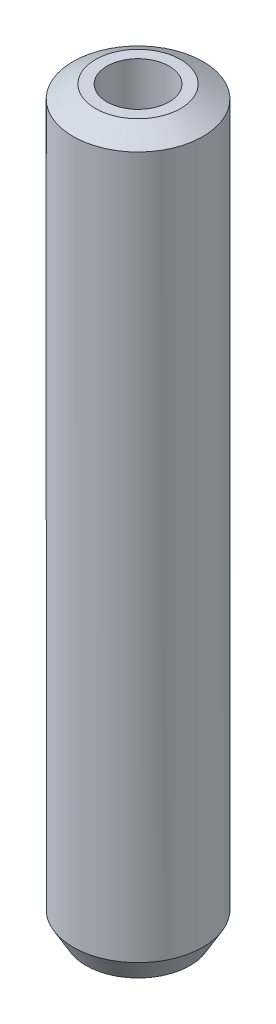
ISO-10303-21;
HEADER;
FILE_DESCRIPTION(('STEP AP214'),'2;1');
FILE_NAME('part.step','',(''),(''),'','','');
FILE_SCHEMA(('AUTOMOTIVE_DESIGN { 1 0 10303 214 1 1 1 1 }'));
ENDSEC;
DATA;
#1=APPLICATION_CONTEXT('core data for automotive mechanical design processes');
#2=APPLICATION_PROTOCOL_DEFINITION('international standard','automotive_design',2000,#1);
#3=PRODUCT_CONTEXT('',#1,'mechanical');
#4=PRODUCT('Part','Part','',(#3));
#5=PRODUCT_RELATED_PRODUCT_CATEGORY('part','',(#4));
#6=PRODUCT_DEFINITION_FORMATION('','',#4);
#7=PRODUCT_DEFINITION_CONTEXT('part definition',#1,'design');
#8=PRODUCT_DEFINITION('design','',#6,#7);
#9=PRODUCT_DEFINITION_SHAPE('','',#8);
#10=(LENGTH_UNIT() NAMED_UNIT(*) SI_UNIT(.MILLI.,.METRE.));
#11=(NAMED_UNIT(*) PLANE_ANGLE_UNIT() SI_UNIT($,.RADIAN.));
#12=(NAMED_UNIT(*) SI_UNIT($,.STERADIAN.) SOLID_ANGLE_UNIT());
#13=UNCERTAINTY_MEASURE_WITH_UNIT(LENGTH_MEASURE(1.E-05),#10,'distance_accuracy_value','');
#14=(GEOMETRIC_REPRESENTATION_CONTEXT(3) GLOBAL_UNCERTAINTY_ASSIGNED_CONTEXT((#13)) GLOBAL_UNIT_ASSIGNED_CONTEXT((#10,
#11,#12)) REPRESENTATION_CONTEXT('',''));
#15=CARTESIAN_POINT('',(0.,0.,0.));
#16=DIRECTION('',(0.,0.,1.));
#17=DIRECTION('',(1.,0.,0.));
#18=AXIS2_PLACEMENT_3D('',#15,#16,#17);
#19=CARTESIAN_POINT('',(0.,113.502418023381,0.));
#20=DIRECTION('',(0.,-1.,0.));
#21=DIRECTION('',(0.,0.,-1.));
#22=AXIS2_PLACEMENT_3D('',#19,#20,#21);
#23=CYLINDRICAL_SURFACE('',#22,10.);
#24=CARTESIAN_POINT('',(0.,111.508102450574,0.));
#25=DIRECTION('',(0.,1.,0.));
#26=DIRECTION('',(0.,0.,1.));
#27=AXIS2_PLACEMENT_3D('',#24,#25,#26);
#28=CIRCLE('',#27,10.);
#29=CARTESIAN_POINT('',(0.,111.508102450574,-10.));
#30=VERTEX_POINT('',#29);
#31=EDGE_CURVE('E50',#30,#30,#28,.F.);
#32=CARTESIAN_POINT('',(0.,3.45425589842778,0.));
#33=DIRECTION('',(0.,1.,0.));
#34=DIRECTION('',(0.,0.,1.));
#35=AXIS2_PLACEMENT_3D('',#32,#33,#34);
#36=CIRCLE('',#35,10.);
#37=CARTESIAN_POINT('',(0.,3.45425589842777,-10.));
#38=VERTEX_POINT('',#37);
#39=EDGE_CURVE('E51',#38,#38,#36,.T.);
#40=CARTESIAN_POINT('',(0.,111.508102450574,-10.));
#41=CARTESIAN_POINT('',(0.,110.382541548989,-10.));
#42=CARTESIAN_POINT('',(0.,109.256980647405,-10.));
#43=CARTESIAN_POINT('',(0.,107.005858844235,-10.));
#44=CARTESIAN_POINT('',(0.,105.88029794265,-10.));
#45=CARTESIAN_POINT('',(0.,103.62917613948,-10.));
#46=CARTESIAN_POINT('',(0.,102.503615237895,-10.));
#47=CARTESIAN_POINT('',(0.,100.252493434726,-10.));
#48=CARTESIAN_POINT('',(0.,99.1269325331408,-10.));
#49=CARTESIAN_POINT('',(0.,96.8758107299711,-10.));
#50=CARTESIAN_POINT('',(0.,95.7502498283862,-10.));
#51=CARTESIAN_POINT('',(0.,93.4991280252165,-10.));
#52=CARTESIAN_POINT('',(0.,92.3735671236316,-10.));
#53=CARTESIAN_POINT('',(0.,90.1224453204619,-10.));
#54=CARTESIAN_POINT('',(0.,88.9968844188771,-10.));
#55=CARTESIAN_POINT('',(0.,86.7457626157073,-10.));
#56=CARTESIAN_POINT('',(0.,85.6202017141225,-10.));
#57=CARTESIAN_POINT('',(0.,83.3690799109528,-10.));
#58=CARTESIAN_POINT('',(0.,82.2435190093679,-10.));
#59=CARTESIAN_POINT('',(0.,79.9923972061982,-10.));
#60=CARTESIAN_POINT('',(0.,78.8668363046133,-10.));
#61=CARTESIAN_POINT('',(0.,76.6157145014436,-10.));
#62=CARTESIAN_POINT('',(0.,75.4901535998587,-10.));
#63=CARTESIAN_POINT('',(0.,73.239031796689,-10.));
#64=CARTESIAN_POINT('',(0.,72.1134708951042,-10.));
#65=CARTESIAN_POINT('',(0.,69.8623490919344,-10.));
#66=CARTESIAN_POINT('',(0.,68.7367881903496,-10.));
#67=CARTESIAN_POINT('',(0.,66.4856663871799,-10.));
#68=CARTESIAN_POINT('',(0.,65.360105485595,-10.));
#69=CARTESIAN_POINT('',(0.,63.1089836824253,-10.));
#70=CARTESIAN_POINT('',(0.,61.9834227808404,-10.));
#71=CARTESIAN_POINT('',(0.,59.7323009776707,-10.));
#72=CARTESIAN_POINT('',(0.,58.6067400760859,-10.));
#73=CARTESIAN_POINT('',(0.,56.3556182729161,-10.));
#74=CARTESIAN_POINT('',(0.,55.2300573713313,-10.));
#75=CARTESIAN_POINT('',(0.,52.9789355681616,-10.));
#76=CARTESIAN_POINT('',(0.,51.8533746665767,-10.));
#77=CARTESIAN_POINT('',(0.,49.602252863407,-10.));
#78=CARTESIAN_POINT('',(0.,48.4766919618221,-10.));
#79=CARTESIAN_POINT('',(0.,46.2255701586524,-10.));
#80=CARTESIAN_POINT('',(0.,45.1000092570676,-10.));
#81=CARTESIAN_POINT('',(0.,42.8488874538978,-10.));
#82=CARTESIAN_POINT('',(0.,41.723326552313,-10.));
#83=CARTESIAN_POINT('',(0.,39.4722047491433,-10.));
#84=CARTESIAN_POINT('',(0.,38.3466438475584,-10.));
#85=CARTESIAN_POINT('',(0.,36.0955220443887,-10.));
#86=CARTESIAN_POINT('',(0.,34.9699611428038,-10.));
#87=CARTESIAN_POINT('',(0.,32.7188393396341,-10.));
#88=CARTESIAN_POINT('',(0.,31.5932784380492,-10.));
#89=CARTESIAN_POINT('',(0.,29.3421566348795,-10.));
#90=CARTESIAN_POINT('',(0.,28.2165957332947,-10.));
#91=CARTESIAN_POINT('',(0.,25.9654739301249,-10.));
#92=CARTESIAN_POINT('',(0.,24.8399130285401,-10.));
#93=CARTESIAN_POINT('',(0.,22.5887912253704,-10.));
#94=CARTESIAN_POINT('',(0.,21.4632303237855,-10.));
#95=CARTESIAN_POINT('',(0.,19.2121085206158,-10.));
#96=CARTESIAN_POINT('',(0.,18.0865476190309,-10.));
#97=CARTESIAN_POINT('',(0.,15.8354258158612,-10.));
#98=CARTESIAN_POINT('',(0.,14.7098649142764,-10.));
#99=CARTESIAN_POINT('',(0.,12.4587431111066,-10.));
#100=CARTESIAN_POINT('',(0.,11.3331822095218,-10.));
#101=CARTESIAN_POINT('',(0.,9.08206040635207,-10.));
#102=CARTESIAN_POINT('',(0.,7.95649950476721,-10.));
#103=CARTESIAN_POINT('',(0.,5.70537770159749,-10.));
#104=CARTESIAN_POINT('',(0.,4.57981680001263,-10.));
#105=CARTESIAN_POINT('',(0.,3.45425589842777,-10.));
#106=B_SPLINE_CURVE_WITH_KNOTS('',3,(#40,#41,#42,#43,#44,#45,#46,#47,#48,#49,#50,#51,#52,#53,
#54,#55,#56,#57,#58,#59,#60,#61,#62,#63,#64,#65,#66,#67,#68,#69,#70,#71,#72,#73,#74,#75,#76,#77,
#78,#79,#80,#81,#82,#83,#84,#85,#86,#87,#88,#89,#90,#91,#92,#93,#94,#95,#96,#97,#98,#99,#100,
#101,#102,#103,#104,#105),.UNSPECIFIED.,.F.,.F.,(4,2,2,2,2,2,2,2,2,2,2,2,2,2,2,2,2,2,2,2,2,2,2,
2,2,2,2,2,2,2,2,2,4),(0.,3.37668270475458,6.75336540950916,10.1300481142637,13.5067308190183,
16.8834135237729,20.2600962285275,23.636778933282,27.0134616380366,30.3901443427912,
33.7668270475458,37.1435097523004,40.5201924570549,43.8968751618095,47.2735578665641,
50.6502405713187,54.0269232760733,57.4036059808278,60.7802886855824,64.156971390337,
67.5336540950916,70.9103367998461,74.2870195046007,77.6637022093553,81.0403849141099,
84.4170676188645,87.793750323619,91.1704330283736,94.5471157331282,97.9237984378828,
101.300481142637,104.677163847392,108.053846552146),.UNSPECIFIED.);
#107=EDGE_CURVE('BSEAM39',#30,#38,#106,.T.);
#108=ORIENTED_EDGE('',*,*,#31,.T.);
#109=ORIENTED_EDGE('',*,*,#39,.T.);
#110=ORIENTED_EDGE('',*,*,#107,.T.);
#111=ORIENTED_EDGE('',*,*,#107,.F.);
#112=EDGE_LOOP('',(#108,#110,#109,#111));
#113=FACE_BOUND('',#112,.T.);
#114=ADVANCED_FACE('F39',(#113),#23,.T.);
#115=CARTESIAN_POINT('',(0.,113.502418023381,0.));
#116=DIRECTION('',(0.,1.,0.));
#117=DIRECTION('',(0.,0.,1.));
#118=AXIS2_PLACEMENT_3D('',#115,#116,#117);
#119=PLANE('',#118);
#120=CARTESIAN_POINT('',(0.,113.502418023381,0.));
#121=DIRECTION('',(0.,1.,0.));
#122=DIRECTION('',(0.,0.,1.));
#123=AXIS2_PLACEMENT_3D('',#120,#121,#122);
#124=CIRCLE('',#123,6.54574410157248);
#125=CARTESIAN_POINT('',(0.,113.502418023381,6.54574410157248));
#126=VERTEX_POINT('',#125);
#127=EDGE_CURVE('E54',#126,#126,#124,.T.);
#128=ORIENTED_EDGE('',*,*,#127,.T.);
#129=EDGE_LOOP('',(#128));
#130=FACE_BOUND('',#129,.T.);
#131=CARTESIAN_POINT('',(0.,113.502418023381,0.));
#132=DIRECTION('',(0.,1.,0.));
#133=DIRECTION('',(0.,0.,1.));
#134=AXIS2_PLACEMENT_3D('',#131,#132,#133);
#135=CIRCLE('',#134,4.78061364346195);
#136=CARTESIAN_POINT('',(0.,113.502418023381,-4.78061364346195));
#137=VERTEX_POINT('',#136);
#138=EDGE_CURVE('E58',#137,#137,#135,.T.);
#139=ORIENTED_EDGE('',*,*,#138,.F.);
#140=EDGE_LOOP('',(#139));
#141=FACE_BOUND('',#140,.T.);
#142=ADVANCED_FACE('F69',(#130,#141),#119,.T.);
#143=CARTESIAN_POINT('',(0.,0.,0.));
#144=DIRECTION('',(0.,1.,0.));
#145=DIRECTION('',(0.,0.,1.));
#146=AXIS2_PLACEMENT_3D('',#143,#144,#145);
#147=PLANE('',#146);
#148=CARTESIAN_POINT('',(0.,0.,0.));
#149=DIRECTION('',(0.,1.,0.));
#150=DIRECTION('',(0.,0.,1.));
#151=AXIS2_PLACEMENT_3D('',#148,#149,#150);
#152=CIRCLE('',#151,8.00568442719285);
#153=CARTESIAN_POINT('',(0.,0.,8.00568442719285));
#154=VERTEX_POINT('',#153);
#155=EDGE_CURVE('E10',#154,#154,#152,.F.);
#156=ORIENTED_EDGE('',*,*,#155,.T.);
#157=EDGE_LOOP('',(#156));
#158=FACE_BOUND('',#157,.T.);
#159=CARTESIAN_POINT('',(0.,0.,0.));
#160=DIRECTION('',(0.,1.,0.));
#161=DIRECTION('',(0.,0.,1.));
#162=AXIS2_PLACEMENT_3D('',#159,#160,#161);
#163=CIRCLE('',#162,4.78061364346195);
#164=CARTESIAN_POINT('',(0.,0.,-4.78061364346195));
#165=VERTEX_POINT('',#164);
#166=EDGE_CURVE('E63',#165,#165,#163,.T.);
#167=ORIENTED_EDGE('',*,*,#166,.T.);
#168=EDGE_LOOP('',(#167));
#169=FACE_BOUND('',#168,.T.);
#170=ADVANCED_FACE('F75',(#158,#169),#147,.F.);
#171=CARTESIAN_POINT('',(0.,113.502418023381,0.));
#172=DIRECTION('',(0.,-1.,0.));
#173=DIRECTION('',(0.,0.,-1.));
#174=AXIS2_PLACEMENT_3D('',#171,#172,#173);
#175=CYLINDRICAL_SURFACE('',#174,4.78061364346195);
#176=CARTESIAN_POINT('',(0.,113.502418023381,-4.78061364346195));
#177=CARTESIAN_POINT('',(0.,112.320101168971,-4.78061364346195));
#178=CARTESIAN_POINT('',(0.,111.137784314561,-4.78061364346195));
#179=CARTESIAN_POINT('',(0.,108.77315060574,-4.78061364346195));
#180=CARTESIAN_POINT('',(0.,107.59083375133,-4.78061364346195));
#181=CARTESIAN_POINT('',(0.,105.22620004251,-4.78061364346195));
#182=CARTESIAN_POINT('',(0.,104.043883188099,-4.78061364346195));
#183=CARTESIAN_POINT('',(0.,101.679249479279,-4.78061364346195));
#184=CARTESIAN_POINT('',(0.,100.496932624869,-4.78061364346195));
#185=CARTESIAN_POINT('',(0.,98.1322989160484,-4.78061364346195));
#186=CARTESIAN_POINT('',(0.,96.9499820616381,-4.78061364346195));
#187=CARTESIAN_POINT('',(0.,94.5853483528177,-4.78061364346195));
#188=CARTESIAN_POINT('',(0.,93.4030314984075,-4.78061364346195));
#189=CARTESIAN_POINT('',(0.,91.038397789587,-4.78061364346195));
#190=CARTESIAN_POINT('',(0.,89.8560809351768,-4.78061364346195));
#191=CARTESIAN_POINT('',(0.,87.4914472263564,-4.78061364346195));
#192=CARTESIAN_POINT('',(0.,86.3091303719462,-4.78061364346195));
#193=CARTESIAN_POINT('',(0.,83.9444966631257,-4.78061364346195));
#194=CARTESIAN_POINT('',(0.,82.7621798087155,-4.78061364346195));
#195=CARTESIAN_POINT('',(0.,80.3975460998951,-4.78061364346195));
#196=CARTESIAN_POINT('',(0.,79.2152292454848,-4.78061364346195));
#197=CARTESIAN_POINT('',(0.,76.8505955366644,-4.78061364346195));
#198=CARTESIAN_POINT('',(0.,75.6682786822542,-4.78061364346195));
#199=CARTESIAN_POINT('',(0.,73.3036449734337,-4.78061364346195));
#200=CARTESIAN_POINT('',(0.,72.1213281190235,-4.78061364346195));
#201=CARTESIAN_POINT('',(0.,69.756694410203,-4.78061364346195));
#202=CARTESIAN_POINT('',(0.,68.5743775557928,-4.78061364346195));
#203=CARTESIAN_POINT('',(0.,66.2097438469724,-4.78061364346195));
#204=CARTESIAN_POINT('',(0.,65.0274269925622,-4.78061364346195));
#205=CARTESIAN_POINT('',(0.,62.6627932837417,-4.78061364346195));
#206=CARTESIAN_POINT('',(0.,61.4804764293315,-4.78061364346195));
#207=CARTESIAN_POINT('',(0.,59.1158427205111,-4.78061364346195));
#208=CARTESIAN_POINT('',(0.,57.9335258661008,-4.78061364346195));
#209=CARTESIAN_POINT('',(0.,55.5688921572804,-4.78061364346195));
#210=CARTESIAN_POINT('',(0.,54.3865753028702,-4.78061364346195));
#211=CARTESIAN_POINT('',(0.,52.0219415940497,-4.78061364346195));
#212=CARTESIAN_POINT('',(0.,50.8396247396395,-4.78061364346195));
#213=CARTESIAN_POINT('',(0.,48.4749910308191,-4.78061364346195));
#214=CARTESIAN_POINT('',(0.,47.2926741764089,-4.78061364346195));
#215=CARTESIAN_POINT('',(0.,44.9280404675884,-4.78061364346195));
#216=CARTESIAN_POINT('',(0.,43.7457236131782,-4.78061364346195));
#217=CARTESIAN_POINT('',(0.,41.3810899043578,-4.78061364346195));
#218=CARTESIAN_POINT('',(0.,40.1987730499475,-4.78061364346195));
#219=CARTESIAN_POINT('',(0.,37.8341393411271,-4.78061364346195));
#220=CARTESIAN_POINT('',(0.,36.6518224867169,-4.78061364346195));
#221=CARTESIAN_POINT('',(0.,34.2871887778964,-4.78061364346195));
#222=CARTESIAN_POINT('',(0.,33.1048719234862,-4.78061364346195));
#223=CARTESIAN_POINT('',(0.,30.7402382146658,-4.78061364346195));
#224=CARTESIAN_POINT('',(0.,29.5579213602555,-4.78061364346195));
#225=CARTESIAN_POINT('',(0.,27.1932876514351,-4.78061364346195));
#226=CARTESIAN_POINT('',(0.,26.0109707970249,-4.78061364346195));
#227=CARTESIAN_POINT('',(0.,23.6463370882044,-4.78061364346195));
#228=CARTESIAN_POINT('',(0.,22.4640202337942,-4.78061364346195));
#229=CARTESIAN_POINT('',(0.,20.0993865249738,-4.78061364346195));
#230=CARTESIAN_POINT('',(0.,18.9170696705635,-4.78061364346195));
#231=CARTESIAN_POINT('',(0.,16.5524359617431,-4.78061364346195));
#232=CARTESIAN_POINT('',(0.,15.3701191073329,-4.78061364346195));
#233=CARTESIAN_POINT('',(0.,13.0054853985124,-4.78061364346195));
#234=CARTESIAN_POINT('',(0.,11.8231685441022,-4.78061364346195));
#235=CARTESIAN_POINT('',(0.,9.45853483528177,-4.78061364346195));
#236=CARTESIAN_POINT('',(0.,8.27621798087155,-4.78061364346195));
#237=CARTESIAN_POINT('',(0.,5.91158427205111,-4.78061364346195));
#238=CARTESIAN_POINT('',(0.,4.72926741764088,-4.78061364346195));
#239=CARTESIAN_POINT('',(0.,2.36463370882044,-4.78061364346195));
#240=CARTESIAN_POINT('',(0.,1.18231685441022,-4.78061364346195));
#241=CARTESIAN_POINT('',(0.,0.,-4.78061364346195));
#242=B_SPLINE_CURVE_WITH_KNOTS('',3,(#176,#177,#178,#179,#180,#181,#182,#183,#184,#185,#186,
#187,#188,#189,#190,#191,#192,#193,#194,#195,#196,#197,#198,#199,#200,#201,#202,#203,#204,#205,
#206,#207,#208,#209,#210,#211,#212,#213,#214,#215,#216,#217,#218,#219,#220,#221,#222,#223,#224,
#225,#226,#227,#228,#229,#230,#231,#232,#233,#234,#235,#236,#237,#238,#239,#240,#241),
.UNSPECIFIED.,.F.,.F.,(4,2,2,2,2,2,2,2,2,2,2,2,2,2,2,2,2,2,2,2,2,2,2,2,2,2,2,2,2,2,2,2,4),(0.,
3.54695056323068,7.09390112646134,10.640851689692,14.1878022529227,17.7347528161533,
21.281703379384,24.8286539426147,28.3756045058453,31.922555069076,35.4695056323066,
39.0164561955373,42.563406758768,46.1103573219986,49.6573078852293,53.20425844846,
56.7512090116906,60.2981595749213,63.8451101381519,67.3920607013826,70.9390112646133,
74.4859618278439,78.0329123910746,81.5798629543053,85.1268135175359,88.6737640807666,
92.2207146439973,95.7676652072279,99.3146157704586,102.861566333689,106.40851689692,
109.955467460151,113.502418023381),.UNSPECIFIED.);
#243=EDGE_CURVE('BSEAM70',#137,#165,#242,.T.);
#244=ORIENTED_EDGE('',*,*,#138,.T.);
#245=ORIENTED_EDGE('',*,*,#166,.F.);
#246=ORIENTED_EDGE('',*,*,#243,.T.);
#247=ORIENTED_EDGE('',*,*,#243,.F.);
#248=EDGE_LOOP('',(#244,#246,#245,#247));
#249=FACE_BOUND('',#248,.T.);
#250=ADVANCED_FACE('F70',(#249),#175,.F.);
#251=CARTESIAN_POINT('',(0.,113.502418023381,0.));
#252=DIRECTION('',(0.,-1.,0.));
#253=DIRECTION('',(0.,0.,-1.));
#254=AXIS2_PLACEMENT_3D('',#251,#252,#253);
#255=CONICAL_SURFACE('',#254,6.54574410157248,1.0471975511966);
#256=ORIENTED_EDGE('',*,*,#31,.F.);
#257=EDGE_LOOP('',(#256));
#258=FACE_BOUND('',#257,.T.);
#259=ORIENTED_EDGE('',*,*,#127,.F.);
#260=EDGE_LOOP('',(#259));
#261=FACE_BOUND('',#260,.T.);
#262=ADVANCED_FACE('F81',(#258,#261),#255,.T.);
#263=CARTESIAN_POINT('',(0.,3.45425589842778,0.));
#264=DIRECTION('',(0.,1.,0.));
#265=DIRECTION('',(0.,0.,1.));
#266=AXIS2_PLACEMENT_3D('',#263,#264,#265);
#267=CONICAL_SURFACE('',#266,10.,0.523598775598303);
#268=ORIENTED_EDGE('',*,*,#155,.F.);
#269=EDGE_LOOP('',(#268));
#270=FACE_BOUND('',#269,.T.);
#271=ORIENTED_EDGE('',*,*,#39,.F.);
#272=EDGE_LOOP('',(#271));
#273=FACE_BOUND('',#272,.T.);
#274=ADVANCED_FACE('F45',(#270,#273),#267,.T.);
#275=CLOSED_SHELL('',(#114,#142,#170,#250,#262,#274));
#276=MANIFOLD_SOLID_BREP('B2',#275);
#277=ADVANCED_BREP_SHAPE_REPRESENTATION('',(#18,#276),#14);
#278=SHAPE_DEFINITION_REPRESENTATION(#9,#277);
ENDSEC;
END-ISO-10303-21;
